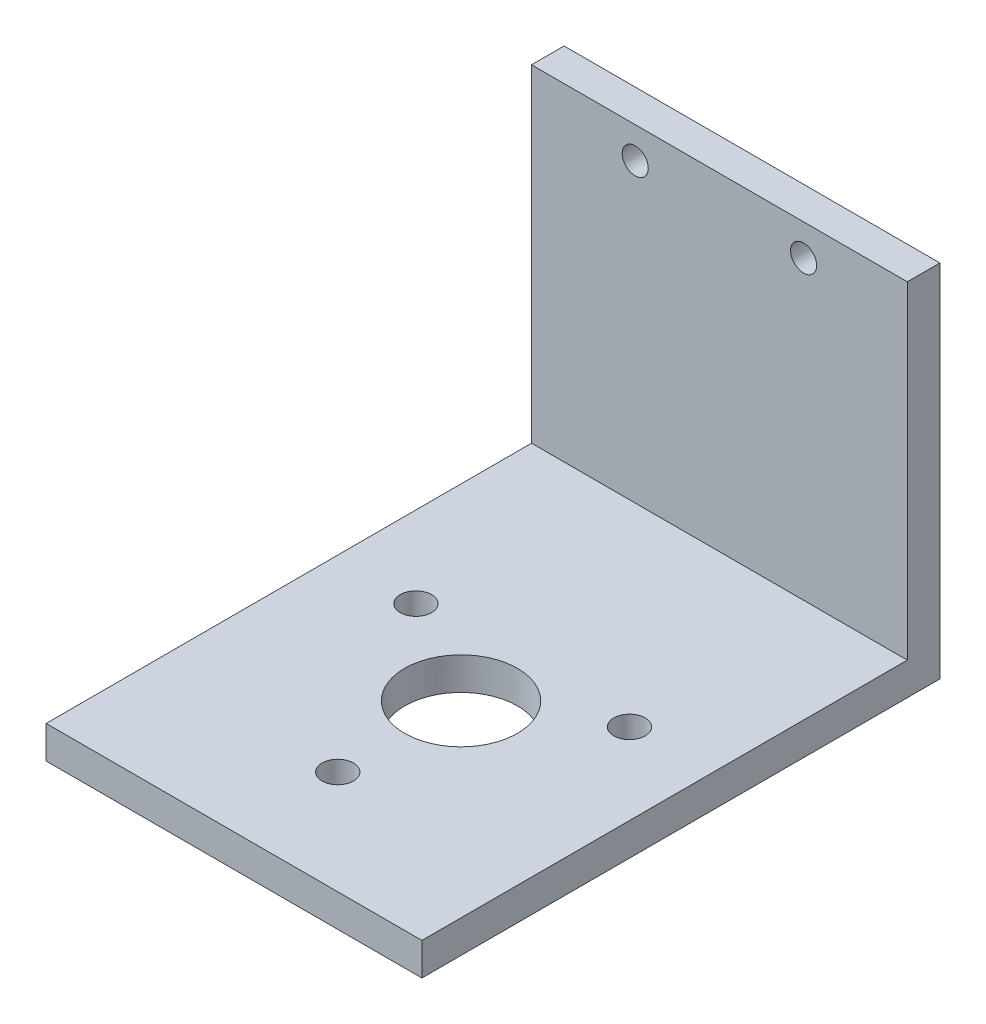
ISO-10303-21;
HEADER;
FILE_DESCRIPTION(('STEP AP214'),'2;1');
FILE_NAME('part.step','',(''),(''),'','','');
FILE_SCHEMA(('AUTOMOTIVE_DESIGN { 1 0 10303 214 1 1 1 1 }'));
ENDSEC;
DATA;
#1=APPLICATION_CONTEXT('core data for automotive mechanical design processes');
#2=APPLICATION_PROTOCOL_DEFINITION('international standard','automotive_design',2000,#1);
#3=PRODUCT_CONTEXT('',#1,'mechanical');
#4=PRODUCT('Part','Part','',(#3));
#5=PRODUCT_RELATED_PRODUCT_CATEGORY('part','',(#4));
#6=PRODUCT_DEFINITION_FORMATION('','',#4);
#7=PRODUCT_DEFINITION_CONTEXT('part definition',#1,'design');
#8=PRODUCT_DEFINITION('design','',#6,#7);
#9=PRODUCT_DEFINITION_SHAPE('','',#8);
#10=(LENGTH_UNIT() NAMED_UNIT(*) SI_UNIT(.MILLI.,.METRE.));
#11=(NAMED_UNIT(*) PLANE_ANGLE_UNIT() SI_UNIT($,.RADIAN.));
#12=(NAMED_UNIT(*) SI_UNIT($,.STERADIAN.) SOLID_ANGLE_UNIT());
#13=UNCERTAINTY_MEASURE_WITH_UNIT(LENGTH_MEASURE(1.E-05),#10,'distance_accuracy_value','');
#14=(GEOMETRIC_REPRESENTATION_CONTEXT(3) GLOBAL_UNCERTAINTY_ASSIGNED_CONTEXT((#13)) GLOBAL_UNIT_ASSIGNED_CONTEXT((#10,
#11,#12)) REPRESENTATION_CONTEXT('',''));
#15=CARTESIAN_POINT('',(0.,0.,0.));
#16=DIRECTION('',(0.,0.,1.));
#17=DIRECTION('',(1.,0.,0.));
#18=AXIS2_PLACEMENT_3D('',#15,#16,#17);
#19=CARTESIAN_POINT('',(0.,0.,0.));
#20=DIRECTION('',(0.,0.,-1.));
#21=DIRECTION('',(-1.,0.,0.));
#22=AXIS2_PLACEMENT_3D('',#19,#20,#21);
#23=PLANE('',#22);
#24=CARTESIAN_POINT('',(21.0312,66.7004,0.));
#25=DIRECTION('',(0.,0.,1.));
#26=DIRECTION('',(1.,0.,0.));
#27=AXIS2_PLACEMENT_3D('',#24,#25,#26);
#28=CIRCLE('',#27,2.64159999999999);
#29=CARTESIAN_POINT('',(23.6728,66.7004,0.));
#30=VERTEX_POINT('',#29);
#31=EDGE_CURVE('E128',#30,#30,#28,.T.);
#32=ORIENTED_EDGE('',*,*,#31,.F.);
#33=EDGE_LOOP('',(#32));
#34=FACE_BOUND('',#33,.T.);
#35=CARTESIAN_POINT('',(55.1688,66.7004,0.));
#36=DIRECTION('',(0.,0.,1.));
#37=DIRECTION('',(-1.,0.,0.));
#38=AXIS2_PLACEMENT_3D('',#35,#36,#37);
#39=CIRCLE('',#38,2.6416);
#40=CARTESIAN_POINT('',(52.5272,66.7004,0.));
#41=VERTEX_POINT('',#40);
#42=EDGE_CURVE('E124',#41,#41,#39,.T.);
#43=ORIENTED_EDGE('',*,*,#42,.F.);
#44=EDGE_LOOP('',(#43));
#45=FACE_BOUND('',#44,.T.);
#46=DIRECTION('',(-1.,0.,0.));
#47=VECTOR('',#46,1.);
#48=CARTESIAN_POINT('',(0.,6.604,0.));
#49=LINE('',#48,#47);
#50=CARTESIAN_POINT('',(76.2,6.604,0.));
#51=VERTEX_POINT('',#50);
#52=CARTESIAN_POINT('',(0.,6.604,0.));
#53=VERTEX_POINT('',#52);
#54=EDGE_CURVE('E52',#51,#53,#49,.T.);
#55=ORIENTED_EDGE('',*,*,#54,.F.);
#56=DIRECTION('',(0.,1.,0.));
#57=VECTOR('',#56,1.);
#58=CARTESIAN_POINT('',(76.2,0.,0.));
#59=LINE('',#58,#57);
#60=CARTESIAN_POINT('',(76.2,73.0504,0.));
#61=VERTEX_POINT('',#60);
#62=EDGE_CURVE('E146',#51,#61,#59,.T.);
#63=ORIENTED_EDGE('',*,*,#62,.T.);
#64=DIRECTION('',(-1.,0.,0.));
#65=VECTOR('',#64,1.);
#66=CARTESIAN_POINT('',(0.,73.0504,0.));
#67=LINE('',#66,#65);
#68=CARTESIAN_POINT('',(0.,73.0504,0.));
#69=VERTEX_POINT('',#68);
#70=EDGE_CURVE('E139',#61,#69,#67,.T.);
#71=ORIENTED_EDGE('',*,*,#70,.T.);
#72=DIRECTION('',(0.,-1.,0.));
#73=VECTOR('',#72,1.);
#74=CARTESIAN_POINT('',(0.,0.,0.));
#75=LINE('',#74,#73);
#76=EDGE_CURVE('E134',#69,#53,#75,.T.);
#77=ORIENTED_EDGE('',*,*,#76,.T.);
#78=EDGE_LOOP('',(#55,#63,#71,#77));
#79=FACE_BOUND('',#78,.T.);
#80=ADVANCED_FACE('F35',(#34,#45,#79),#23,.F.);
#81=CARTESIAN_POINT('',(0.,0.,-6.604));
#82=DIRECTION('',(-1.,0.,0.));
#83=DIRECTION('',(0.,0.,1.));
#84=AXIS2_PLACEMENT_3D('',#81,#82,#83);
#85=PLANE('',#84);
#86=ORIENTED_EDGE('',*,*,#76,.F.);
#87=DIRECTION('',(0.,0.,1.));
#88=VECTOR('',#87,1.);
#89=CARTESIAN_POINT('',(0.,73.0504,-6.604));
#90=LINE('',#89,#88);
#91=CARTESIAN_POINT('',(0.,73.0504,-6.604));
#92=VERTEX_POINT('',#91);
#93=EDGE_CURVE('E11',#92,#69,#90,.T.);
#94=ORIENTED_EDGE('',*,*,#93,.F.);
#95=DIRECTION('',(0.,-1.,0.));
#96=VECTOR('',#95,1.);
#97=CARTESIAN_POINT('',(0.,0.,-6.604));
#98=LINE('',#97,#96);
#99=CARTESIAN_POINT('',(0.,0.,-6.604));
#100=VERTEX_POINT('',#99);
#101=EDGE_CURVE('E97',#92,#100,#98,.T.);
#102=ORIENTED_EDGE('',*,*,#101,.T.);
#103=DIRECTION('',(0.,0.,1.));
#104=VECTOR('',#103,1.);
#105=CARTESIAN_POINT('',(0.,0.,-6.604));
#106=LINE('',#105,#104);
#107=CARTESIAN_POINT('',(0.,0.,98.425));
#108=VERTEX_POINT('',#107);
#109=EDGE_CURVE('E39',#100,#108,#106,.T.);
#110=ORIENTED_EDGE('',*,*,#109,.T.);
#111=DIRECTION('',(0.,-1.,0.));
#112=VECTOR('',#111,1.);
#113=CARTESIAN_POINT('',(0.,6.604,98.425));
#114=LINE('',#113,#112);
#115=CARTESIAN_POINT('',(0.,6.604,98.425));
#116=VERTEX_POINT('',#115);
#117=EDGE_CURVE('E96',#116,#108,#114,.T.);
#118=ORIENTED_EDGE('',*,*,#117,.F.);
#119=DIRECTION('',(0.,0.,-1.));
#120=VECTOR('',#119,1.);
#121=CARTESIAN_POINT('',(0.,6.604,98.425));
#122=LINE('',#121,#120);
#123=EDGE_CURVE('E118',#116,#53,#122,.T.);
#124=ORIENTED_EDGE('',*,*,#123,.T.);
#125=EDGE_LOOP('',(#86,#94,#102,#110,#118,#124));
#126=FACE_BOUND('',#125,.T.);
#127=ADVANCED_FACE('F37',(#126),#85,.T.);
#128=CARTESIAN_POINT('',(0.,73.0504,-6.604));
#129=DIRECTION('',(0.,1.,0.));
#130=DIRECTION('',(-1.,0.,0.));
#131=AXIS2_PLACEMENT_3D('',#128,#129,#130);
#132=PLANE('',#131);
#133=ORIENTED_EDGE('',*,*,#70,.F.);
#134=DIRECTION('',(0.,0.,1.));
#135=VECTOR('',#134,1.);
#136=CARTESIAN_POINT('',(76.2,73.0504,-6.604));
#137=LINE('',#136,#135);
#138=CARTESIAN_POINT('',(76.2,73.0504,-6.604));
#139=VERTEX_POINT('',#138);
#140=EDGE_CURVE('E44',#139,#61,#137,.T.);
#141=ORIENTED_EDGE('',*,*,#140,.F.);
#142=DIRECTION('',(-1.,0.,0.));
#143=VECTOR('',#142,1.);
#144=CARTESIAN_POINT('',(0.,73.0504,-6.604));
#145=LINE('',#144,#143);
#146=EDGE_CURVE('E99',#139,#92,#145,.T.);
#147=ORIENTED_EDGE('',*,*,#146,.T.);
#148=ORIENTED_EDGE('',*,*,#93,.T.);
#149=EDGE_LOOP('',(#133,#141,#147,#148));
#150=FACE_BOUND('',#149,.T.);
#151=ADVANCED_FACE('F156',(#150),#132,.T.);
#152=CARTESIAN_POINT('',(76.2,0.,-6.604));
#153=DIRECTION('',(1.,0.,0.));
#154=DIRECTION('',(0.,1.,0.));
#155=AXIS2_PLACEMENT_3D('',#152,#153,#154);
#156=PLANE('',#155);
#157=ORIENTED_EDGE('',*,*,#62,.F.);
#158=DIRECTION('',(0.,0.,-1.));
#159=VECTOR('',#158,1.);
#160=CARTESIAN_POINT('',(76.2,6.604,98.425));
#161=LINE('',#160,#159);
#162=CARTESIAN_POINT('',(76.2,6.604,98.425));
#163=VERTEX_POINT('',#162);
#164=EDGE_CURVE('E121',#163,#51,#161,.T.);
#165=ORIENTED_EDGE('',*,*,#164,.F.);
#166=DIRECTION('',(0.,1.,0.));
#167=VECTOR('',#166,1.);
#168=CARTESIAN_POINT('',(76.2,6.604,98.425));
#169=LINE('',#168,#167);
#170=CARTESIAN_POINT('',(76.2,0.,98.425));
#171=VERTEX_POINT('',#170);
#172=EDGE_CURVE('E105',#171,#163,#169,.T.);
#173=ORIENTED_EDGE('',*,*,#172,.F.);
#174=DIRECTION('',(0.,0.,1.));
#175=VECTOR('',#174,1.);
#176=CARTESIAN_POINT('',(76.2,0.,-6.604));
#177=LINE('',#176,#175);
#178=CARTESIAN_POINT('',(76.2,0.,-6.604));
#179=VERTEX_POINT('',#178);
#180=EDGE_CURVE('E98',#179,#171,#177,.T.);
#181=ORIENTED_EDGE('',*,*,#180,.F.);
#182=DIRECTION('',(0.,1.,0.));
#183=VECTOR('',#182,1.);
#184=CARTESIAN_POINT('',(76.2,0.,-6.604));
#185=LINE('',#184,#183);
#186=EDGE_CURVE('E141',#179,#139,#185,.T.);
#187=ORIENTED_EDGE('',*,*,#186,.T.);
#188=ORIENTED_EDGE('',*,*,#140,.T.);
#189=EDGE_LOOP('',(#157,#165,#173,#181,#187,#188));
#190=FACE_BOUND('',#189,.T.);
#191=ADVANCED_FACE('F152',(#190),#156,.T.);
#192=CARTESIAN_POINT('',(0.,0.,-6.604));
#193=DIRECTION('',(0.,-1.,0.));
#194=DIRECTION('',(1.,0.,0.));
#195=AXIS2_PLACEMENT_3D('',#192,#193,#194);
#196=PLANE('',#195);
#197=CARTESIAN_POINT('',(59.7506350946111,0.,39.8875000000002));
#198=DIRECTION('',(0.,-1.,0.));
#199=DIRECTION('',(1.,0.,0.));
#200=AXIS2_PLACEMENT_3D('',#197,#198,#199);
#201=CIRCLE('',#200,3.17499999999999);
#202=CARTESIAN_POINT('',(62.9256350946111,0.,39.8875000000002));
#203=VERTEX_POINT('',#202);
#204=EDGE_CURVE('E112',#203,#203,#201,.T.);
#205=ORIENTED_EDGE('',*,*,#204,.F.);
#206=EDGE_LOOP('',(#205));
#207=FACE_BOUND('',#206,.T.);
#208=CARTESIAN_POINT('',(16.4493649053891,0.,39.8874999999999));
#209=DIRECTION('',(0.,-1.,0.));
#210=DIRECTION('',(1.,0.,0.));
#211=AXIS2_PLACEMENT_3D('',#208,#209,#210);
#212=CIRCLE('',#211,3.175);
#213=CARTESIAN_POINT('',(19.6243649053891,0.,39.8874999999999));
#214=VERTEX_POINT('',#213);
#215=EDGE_CURVE('E321',#214,#214,#212,.T.);
#216=ORIENTED_EDGE('',*,*,#215,.F.);
#217=EDGE_LOOP('',(#216));
#218=FACE_BOUND('',#217,.T.);
#219=CARTESIAN_POINT('',(38.1,0.,77.3875));
#220=DIRECTION('',(0.,-1.,0.));
#221=DIRECTION('',(1.,0.,0.));
#222=AXIS2_PLACEMENT_3D('',#219,#220,#221);
#223=CIRCLE('',#222,3.175);
#224=CARTESIAN_POINT('',(41.275,0.,77.3875));
#225=VERTEX_POINT('',#224);
#226=EDGE_CURVE('E319',#225,#225,#223,.T.);
#227=ORIENTED_EDGE('',*,*,#226,.F.);
#228=EDGE_LOOP('',(#227));
#229=FACE_BOUND('',#228,.T.);
#230=CARTESIAN_POINT('',(38.1,0.,52.3875));
#231=DIRECTION('',(0.,-1.,0.));
#232=DIRECTION('',(1.,0.,0.));
#233=AXIS2_PLACEMENT_3D('',#230,#231,#232);
#234=CIRCLE('',#233,11.43);
#235=CARTESIAN_POINT('',(49.53,0.,52.3875));
#236=VERTEX_POINT('',#235);
#237=EDGE_CURVE('E316',#236,#236,#234,.T.);
#238=ORIENTED_EDGE('',*,*,#237,.F.);
#239=EDGE_LOOP('',(#238));
#240=FACE_BOUND('',#239,.T.);
#241=ORIENTED_EDGE('',*,*,#180,.T.);
#242=DIRECTION('',(1.,0.,0.));
#243=VECTOR('',#242,1.);
#244=CARTESIAN_POINT('',(0.,0.,98.425));
#245=LINE('',#244,#243);
#246=EDGE_CURVE('E101',#108,#171,#245,.T.);
#247=ORIENTED_EDGE('',*,*,#246,.F.);
#248=ORIENTED_EDGE('',*,*,#109,.F.);
#249=DIRECTION('',(1.,0.,0.));
#250=VECTOR('',#249,1.);
#251=CARTESIAN_POINT('',(0.,0.,-6.604));
#252=LINE('',#251,#250);
#253=EDGE_CURVE('E138',#100,#179,#252,.T.);
#254=ORIENTED_EDGE('',*,*,#253,.T.);
#255=EDGE_LOOP('',(#241,#247,#248,#254));
#256=FACE_BOUND('',#255,.T.);
#257=ADVANCED_FACE('F102',(#207,#218,#229,#240,#256),#196,.T.);
#258=CARTESIAN_POINT('',(0.,0.,-6.604));
#259=DIRECTION('',(0.,0.,-1.));
#260=DIRECTION('',(-1.,0.,0.));
#261=AXIS2_PLACEMENT_3D('',#258,#259,#260);
#262=PLANE('',#261);
#263=CARTESIAN_POINT('',(55.1688,66.7004,-6.604));
#264=DIRECTION('',(0.,0.,1.));
#265=DIRECTION('',(-1.,0.,0.));
#266=AXIS2_PLACEMENT_3D('',#263,#264,#265);
#267=CIRCLE('',#266,2.6416);
#268=CARTESIAN_POINT('',(52.5272,66.7004,-6.604));
#269=VERTEX_POINT('',#268);
#270=EDGE_CURVE('E125',#269,#269,#267,.T.);
#271=ORIENTED_EDGE('',*,*,#270,.T.);
#272=EDGE_LOOP('',(#271));
#273=FACE_BOUND('',#272,.T.);
#274=CARTESIAN_POINT('',(21.0312,66.7004,-6.604));
#275=DIRECTION('',(0.,0.,1.));
#276=DIRECTION('',(1.,0.,0.));
#277=AXIS2_PLACEMENT_3D('',#274,#275,#276);
#278=CIRCLE('',#277,2.64159999999999);
#279=CARTESIAN_POINT('',(23.6728,66.7004,-6.604));
#280=VERTEX_POINT('',#279);
#281=EDGE_CURVE('E131',#280,#280,#278,.T.);
#282=ORIENTED_EDGE('',*,*,#281,.T.);
#283=EDGE_LOOP('',(#282));
#284=FACE_BOUND('',#283,.T.);
#285=ORIENTED_EDGE('',*,*,#101,.F.);
#286=ORIENTED_EDGE('',*,*,#146,.F.);
#287=ORIENTED_EDGE('',*,*,#186,.F.);
#288=ORIENTED_EDGE('',*,*,#253,.F.);
#289=EDGE_LOOP('',(#285,#286,#287,#288));
#290=FACE_BOUND('',#289,.T.);
#291=ADVANCED_FACE('F160',(#273,#284,#290),#262,.T.);
#292=CARTESIAN_POINT('',(21.0312,66.7004,-6.604));
#293=DIRECTION('',(0.,0.,1.));
#294=DIRECTION('',(1.,0.,0.));
#295=AXIS2_PLACEMENT_3D('',#292,#293,#294);
#296=CYLINDRICAL_SURFACE('',#295,2.64159999999999);
#297=ORIENTED_EDGE('',*,*,#281,.F.);
#298=EDGE_LOOP('',(#297));
#299=FACE_BOUND('',#298,.T.);
#300=ORIENTED_EDGE('',*,*,#31,.T.);
#301=EDGE_LOOP('',(#300));
#302=FACE_BOUND('',#301,.T.);
#303=ADVANCED_FACE('F162',(#299,#302),#296,.F.);
#304=CARTESIAN_POINT('',(55.1688,66.7004,-6.604));
#305=DIRECTION('',(0.,0.,1.));
#306=DIRECTION('',(1.,0.,0.));
#307=AXIS2_PLACEMENT_3D('',#304,#305,#306);
#308=CYLINDRICAL_SURFACE('',#307,2.6416);
#309=ORIENTED_EDGE('',*,*,#270,.F.);
#310=EDGE_LOOP('',(#309));
#311=FACE_BOUND('',#310,.T.);
#312=ORIENTED_EDGE('',*,*,#42,.T.);
#313=EDGE_LOOP('',(#312));
#314=FACE_BOUND('',#313,.T.);
#315=ADVANCED_FACE('F169',(#311,#314),#308,.F.);
#316=CARTESIAN_POINT('',(0.,6.604,98.425));
#317=DIRECTION('',(0.,-1.,0.));
#318=DIRECTION('',(1.,0.,0.));
#319=AXIS2_PLACEMENT_3D('',#316,#317,#318);
#320=PLANE('',#319);
#321=CARTESIAN_POINT('',(59.7506350946111,6.604,39.8875000000002));
#322=DIRECTION('',(0.,1.,0.));
#323=DIRECTION('',(-1.,0.,0.));
#324=AXIS2_PLACEMENT_3D('',#321,#322,#323);
#325=CIRCLE('',#324,3.17499999999999);
#326=CARTESIAN_POINT('',(56.5756350946111,6.604,39.8875000000002));
#327=VERTEX_POINT('',#326);
#328=EDGE_CURVE('E305',#327,#327,#325,.T.);
#329=ORIENTED_EDGE('',*,*,#328,.F.);
#330=EDGE_LOOP('',(#329));
#331=FACE_BOUND('',#330,.T.);
#332=CARTESIAN_POINT('',(16.4493649053891,6.604,39.8874999999999));
#333=DIRECTION('',(0.,1.,0.));
#334=DIRECTION('',(-1.,0.,0.));
#335=AXIS2_PLACEMENT_3D('',#332,#333,#334);
#336=CIRCLE('',#335,3.175);
#337=CARTESIAN_POINT('',(13.2743649053891,6.604,39.8874999999999));
#338=VERTEX_POINT('',#337);
#339=EDGE_CURVE('E306',#338,#338,#336,.T.);
#340=ORIENTED_EDGE('',*,*,#339,.F.);
#341=EDGE_LOOP('',(#340));
#342=FACE_BOUND('',#341,.T.);
#343=CARTESIAN_POINT('',(38.1,6.604,77.3875));
#344=DIRECTION('',(0.,1.,0.));
#345=DIRECTION('',(-1.,0.,0.));
#346=AXIS2_PLACEMENT_3D('',#343,#344,#345);
#347=CIRCLE('',#346,3.175);
#348=CARTESIAN_POINT('',(34.925,6.604,77.3875));
#349=VERTEX_POINT('',#348);
#350=EDGE_CURVE('E309',#349,#349,#347,.T.);
#351=ORIENTED_EDGE('',*,*,#350,.F.);
#352=EDGE_LOOP('',(#351));
#353=FACE_BOUND('',#352,.T.);
#354=CARTESIAN_POINT('',(38.1,6.604,52.3875));
#355=DIRECTION('',(0.,1.,0.));
#356=DIRECTION('',(-1.,0.,0.));
#357=AXIS2_PLACEMENT_3D('',#354,#355,#356);
#358=CIRCLE('',#357,11.43);
#359=CARTESIAN_POINT('',(26.67,6.604,52.3875));
#360=VERTEX_POINT('',#359);
#361=EDGE_CURVE('E313',#360,#360,#358,.T.);
#362=ORIENTED_EDGE('',*,*,#361,.F.);
#363=EDGE_LOOP('',(#362));
#364=FACE_BOUND('',#363,.T.);
#365=ORIENTED_EDGE('',*,*,#54,.T.);
#366=ORIENTED_EDGE('',*,*,#123,.F.);
#367=DIRECTION('',(-1.,0.,0.));
#368=VECTOR('',#367,1.);
#369=CARTESIAN_POINT('',(0.,6.604,98.425));
#370=LINE('',#369,#368);
#371=EDGE_CURVE('E109',#163,#116,#370,.T.);
#372=ORIENTED_EDGE('',*,*,#371,.F.);
#373=ORIENTED_EDGE('',*,*,#164,.T.);
#374=EDGE_LOOP('',(#365,#366,#372,#373));
#375=FACE_BOUND('',#374,.T.);
#376=ADVANCED_FACE('F158',(#331,#342,#353,#364,#375),#320,.F.);
#377=CARTESIAN_POINT('',(0.,0.,98.425));
#378=DIRECTION('',(0.,0.,1.));
#379=DIRECTION('',(1.,0.,0.));
#380=AXIS2_PLACEMENT_3D('',#377,#378,#379);
#381=PLANE('',#380);
#382=ORIENTED_EDGE('',*,*,#117,.T.);
#383=ORIENTED_EDGE('',*,*,#246,.T.);
#384=ORIENTED_EDGE('',*,*,#172,.T.);
#385=ORIENTED_EDGE('',*,*,#371,.T.);
#386=EDGE_LOOP('',(#382,#383,#384,#385));
#387=FACE_BOUND('',#386,.T.);
#388=ADVANCED_FACE('F107',(#387),#381,.T.);
#389=CARTESIAN_POINT('',(38.1,-69.596,52.3875));
#390=DIRECTION('',(0.,1.,0.));
#391=DIRECTION('',(-1.,0.,0.));
#392=AXIS2_PLACEMENT_3D('',#389,#390,#391);
#393=CYLINDRICAL_SURFACE('',#392,11.43);
#394=ORIENTED_EDGE('',*,*,#237,.T.);
#395=EDGE_LOOP('',(#394));
#396=FACE_BOUND('',#395,.T.);
#397=ORIENTED_EDGE('',*,*,#361,.T.);
#398=EDGE_LOOP('',(#397));
#399=FACE_BOUND('',#398,.T.);
#400=ADVANCED_FACE('F215',(#396,#399),#393,.F.);
#401=CARTESIAN_POINT('',(38.1,-69.596,77.3875));
#402=DIRECTION('',(0.,1.,0.));
#403=DIRECTION('',(-1.,0.,0.));
#404=AXIS2_PLACEMENT_3D('',#401,#402,#403);
#405=CYLINDRICAL_SURFACE('',#404,3.175);
#406=ORIENTED_EDGE('',*,*,#226,.T.);
#407=EDGE_LOOP('',(#406));
#408=FACE_BOUND('',#407,.T.);
#409=ORIENTED_EDGE('',*,*,#350,.T.);
#410=EDGE_LOOP('',(#409));
#411=FACE_BOUND('',#410,.T.);
#412=ADVANCED_FACE('F220',(#408,#411),#405,.F.);
#413=CARTESIAN_POINT('',(16.4493649053891,-69.596,39.8874999999999));
#414=DIRECTION('',(0.,1.,0.));
#415=DIRECTION('',(-1.,0.,0.));
#416=AXIS2_PLACEMENT_3D('',#413,#414,#415);
#417=CYLINDRICAL_SURFACE('',#416,3.175);
#418=ORIENTED_EDGE('',*,*,#215,.T.);
#419=EDGE_LOOP('',(#418));
#420=FACE_BOUND('',#419,.T.);
#421=ORIENTED_EDGE('',*,*,#339,.T.);
#422=EDGE_LOOP('',(#421));
#423=FACE_BOUND('',#422,.T.);
#424=ADVANCED_FACE('F230',(#420,#423),#417,.F.);
#425=CARTESIAN_POINT('',(59.7506350946111,-69.596,39.8875000000002));
#426=DIRECTION('',(0.,1.,0.));
#427=DIRECTION('',(-1.,0.,0.));
#428=AXIS2_PLACEMENT_3D('',#425,#426,#427);
#429=CYLINDRICAL_SURFACE('',#428,3.17499999999999);
#430=ORIENTED_EDGE('',*,*,#204,.T.);
#431=EDGE_LOOP('',(#430));
#432=FACE_BOUND('',#431,.T.);
#433=ORIENTED_EDGE('',*,*,#328,.T.);
#434=EDGE_LOOP('',(#433));
#435=FACE_BOUND('',#434,.T.);
#436=ADVANCED_FACE('F240',(#432,#435),#429,.F.);
#437=CLOSED_SHELL('',(#80,#127,#151,#191,#257,#291,#303,#315,#376,#388,#400,#412,#424,#436));
#438=MANIFOLD_SOLID_BREP('B2',#437);
#439=ADVANCED_BREP_SHAPE_REPRESENTATION('',(#18,#438),#14);
#440=SHAPE_DEFINITION_REPRESENTATION(#9,#439);
ENDSEC;
END-ISO-10303-21;
